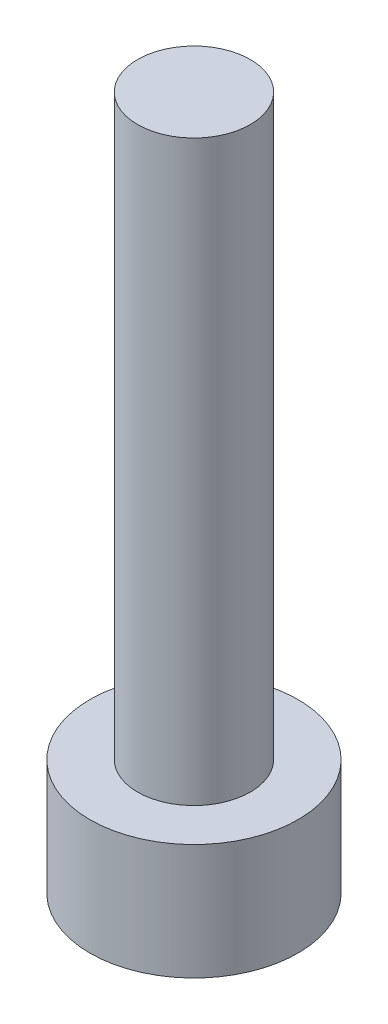
ISO-10303-21;
HEADER;
FILE_DESCRIPTION(('STEP AP214'),'2;1');
FILE_NAME('part.step','',(''),(''),'','','');
FILE_SCHEMA(('AUTOMOTIVE_DESIGN { 1 0 10303 214 1 1 1 1 }'));
ENDSEC;
DATA;
#1=APPLICATION_CONTEXT('core data for automotive mechanical design processes');
#2=APPLICATION_PROTOCOL_DEFINITION('international standard','automotive_design',2000,#1);
#3=PRODUCT_CONTEXT('',#1,'mechanical');
#4=PRODUCT('Part','Part','',(#3));
#5=PRODUCT_RELATED_PRODUCT_CATEGORY('part','',(#4));
#6=PRODUCT_DEFINITION_FORMATION('','',#4);
#7=PRODUCT_DEFINITION_CONTEXT('part definition',#1,'design');
#8=PRODUCT_DEFINITION('design','',#6,#7);
#9=PRODUCT_DEFINITION_SHAPE('','',#8);
#10=(LENGTH_UNIT() NAMED_UNIT(*) SI_UNIT(.MILLI.,.METRE.));
#11=(NAMED_UNIT(*) PLANE_ANGLE_UNIT() SI_UNIT($,.RADIAN.));
#12=(NAMED_UNIT(*) SI_UNIT($,.STERADIAN.) SOLID_ANGLE_UNIT());
#13=UNCERTAINTY_MEASURE_WITH_UNIT(LENGTH_MEASURE(1.E-05),#10,'distance_accuracy_value','');
#14=(GEOMETRIC_REPRESENTATION_CONTEXT(3) GLOBAL_UNCERTAINTY_ASSIGNED_CONTEXT((#13)) GLOBAL_UNIT_ASSIGNED_CONTEXT((#10,
#11,#12)) REPRESENTATION_CONTEXT('',''));
#15=CARTESIAN_POINT('',(0.,0.,0.));
#16=DIRECTION('',(0.,0.,1.));
#17=DIRECTION('',(1.,0.,0.));
#18=AXIS2_PLACEMENT_3D('',#15,#16,#17);
#19=CARTESIAN_POINT('',(0.,4.,0.));
#20=DIRECTION('',(0.,-1.,0.));
#21=DIRECTION('',(0.,0.,-1.));
#22=AXIS2_PLACEMENT_3D('',#19,#20,#21);
#23=CYLINDRICAL_SURFACE('',#22,3.6);
#24=CARTESIAN_POINT('',(0.,4.,0.));
#25=DIRECTION('',(0.,1.,0.));
#26=DIRECTION('',(0.,0.,1.));
#27=AXIS2_PLACEMENT_3D('',#24,#25,#26);
#28=CIRCLE('',#27,3.6);
#29=CARTESIAN_POINT('',(0.,4.,3.6));
#30=VERTEX_POINT('',#29);
#31=EDGE_CURVE('E44',#30,#30,#28,.T.);
#32=ORIENTED_EDGE('',*,*,#31,.F.);
#33=EDGE_LOOP('',(#32));
#34=FACE_BOUND('',#33,.T.);
#35=CARTESIAN_POINT('',(0.,0.,0.));
#36=DIRECTION('',(0.,1.,0.));
#37=DIRECTION('',(0.,0.,1.));
#38=AXIS2_PLACEMENT_3D('',#35,#36,#37);
#39=CIRCLE('',#38,3.6);
#40=CARTESIAN_POINT('',(0.,0.,3.6));
#41=VERTEX_POINT('',#40);
#42=EDGE_CURVE('E39',#41,#41,#39,.T.);
#43=ORIENTED_EDGE('',*,*,#42,.T.);
#44=EDGE_LOOP('',(#43));
#45=FACE_BOUND('',#44,.T.);
#46=ADVANCED_FACE('F36',(#34,#45),#23,.T.);
#47=CARTESIAN_POINT('',(0.,4.,0.));
#48=DIRECTION('',(0.,1.,0.));
#49=DIRECTION('',(0.,0.,1.));
#50=AXIS2_PLACEMENT_3D('',#47,#48,#49);
#51=PLANE('',#50);
#52=CARTESIAN_POINT('',(0.,4.,0.));
#53=DIRECTION('',(0.,1.,0.));
#54=DIRECTION('',(0.,0.,1.));
#55=AXIS2_PLACEMENT_3D('',#52,#53,#54);
#56=CIRCLE('',#55,1.95);
#57=CARTESIAN_POINT('',(0.,4.,1.95));
#58=VERTEX_POINT('',#57);
#59=EDGE_CURVE('E11',#58,#58,#56,.T.);
#60=ORIENTED_EDGE('',*,*,#59,.F.);
#61=EDGE_LOOP('',(#60));
#62=FACE_BOUND('',#61,.T.);
#63=ORIENTED_EDGE('',*,*,#31,.T.);
#64=EDGE_LOOP('',(#63));
#65=FACE_BOUND('',#64,.T.);
#66=ADVANCED_FACE('F156',(#62,#65),#51,.T.);
#67=CARTESIAN_POINT('',(0.,0.,0.));
#68=DIRECTION('',(0.,1.,0.));
#69=DIRECTION('',(0.,0.,1.));
#70=AXIS2_PLACEMENT_3D('',#67,#68,#69);
#71=PLANE('',#70);
#72=DIRECTION('',(-0.866025403784438,0.,-0.500000000000001));
#73=VECTOR('',#72,1.);
#74=CARTESIAN_POINT('',(0.,0.,2.02268156770335));
#75=LINE('',#74,#73);
#76=CARTESIAN_POINT('',(0.,0.,2.02268156770335));
#77=VERTEX_POINT('',#76);
#78=CARTESIAN_POINT('',(-1.75169362139764,0.,1.01134078385167));
#79=VERTEX_POINT('',#78);
#80=EDGE_CURVE('E126',#77,#79,#75,.T.);
#81=ORIENTED_EDGE('',*,*,#80,.F.);
#82=DIRECTION('',(-0.866025403784442,0.,0.499999999999995));
#83=VECTOR('',#82,1.);
#84=CARTESIAN_POINT('',(1.75169362139763,0.,1.0113407838517));
#85=LINE('',#84,#83);
#86=CARTESIAN_POINT('',(1.75169362139763,0.,1.0113407838517));
#87=VERTEX_POINT('',#86);
#88=EDGE_CURVE('E52',#87,#77,#85,.T.);
#89=ORIENTED_EDGE('',*,*,#88,.F.);
#90=DIRECTION('',(0.,0.,1.));
#91=VECTOR('',#90,1.);
#92=CARTESIAN_POINT('',(1.75169362139765,0.,-1.01134078385166));
#93=LINE('',#92,#91);
#94=CARTESIAN_POINT('',(1.75169362139765,0.,-1.01134078385166));
#95=VERTEX_POINT('',#94);
#96=EDGE_CURVE('E135',#95,#87,#93,.T.);
#97=ORIENTED_EDGE('',*,*,#96,.F.);
#98=DIRECTION('',(0.866025403784435,0.,0.500000000000007));
#99=VECTOR('',#98,1.);
#100=CARTESIAN_POINT('',(0.,0.,-2.02268156770335));
#101=LINE('',#100,#99);
#102=CARTESIAN_POINT('',(0.,0.,-2.02268156770335));
#103=VERTEX_POINT('',#102);
#104=EDGE_CURVE('E133',#103,#95,#101,.T.);
#105=ORIENTED_EDGE('',*,*,#104,.F.);
#106=DIRECTION('',(0.866025403784442,0.,-0.499999999999995));
#107=VECTOR('',#106,1.);
#108=CARTESIAN_POINT('',(-1.75169362139763,0.,-1.01134078385169));
#109=LINE('',#108,#107);
#110=CARTESIAN_POINT('',(-1.75169362139763,0.,-1.01134078385169));
#111=VERTEX_POINT('',#110);
#112=EDGE_CURVE('E100',#111,#103,#109,.T.);
#113=ORIENTED_EDGE('',*,*,#112,.F.);
#114=DIRECTION('',(0.,0.,-1.));
#115=VECTOR('',#114,1.);
#116=CARTESIAN_POINT('',(-1.75169362139764,0.,1.01134078385167));
#117=LINE('',#116,#115);
#118=EDGE_CURVE('E129',#79,#111,#117,.T.);
#119=ORIENTED_EDGE('',*,*,#118,.F.);
#120=EDGE_LOOP('',(#81,#89,#97,#105,#113,#119));
#121=FACE_BOUND('',#120,.T.);
#122=ORIENTED_EDGE('',*,*,#42,.F.);
#123=EDGE_LOOP('',(#122));
#124=FACE_BOUND('',#123,.T.);
#125=ADVANCED_FACE('F153',(#121,#124),#71,.F.);
#126=CARTESIAN_POINT('',(0.,24.,0.));
#127=DIRECTION('',(0.,-1.,0.));
#128=DIRECTION('',(0.,0.,-1.));
#129=AXIS2_PLACEMENT_3D('',#126,#127,#128);
#130=CYLINDRICAL_SURFACE('',#129,1.95);
#131=CARTESIAN_POINT('',(0.,24.,0.));
#132=DIRECTION('',(0.,1.,0.));
#133=DIRECTION('',(0.,0.,1.));
#134=AXIS2_PLACEMENT_3D('',#131,#132,#133);
#135=CIRCLE('',#134,1.95);
#136=CARTESIAN_POINT('',(0.,24.,1.95));
#137=VERTEX_POINT('',#136);
#138=EDGE_CURVE('E139',#137,#137,#135,.T.);
#139=ORIENTED_EDGE('',*,*,#138,.F.);
#140=EDGE_LOOP('',(#139));
#141=FACE_BOUND('',#140,.T.);
#142=ORIENTED_EDGE('',*,*,#59,.T.);
#143=EDGE_LOOP('',(#142));
#144=FACE_BOUND('',#143,.T.);
#145=ADVANCED_FACE('F155',(#141,#144),#130,.T.);
#146=CARTESIAN_POINT('',(0.,24.,0.));
#147=DIRECTION('',(0.,1.,0.));
#148=DIRECTION('',(0.,0.,1.));
#149=AXIS2_PLACEMENT_3D('',#146,#147,#148);
#150=PLANE('',#149);
#151=ORIENTED_EDGE('',*,*,#138,.T.);
#152=EDGE_LOOP('',(#151));
#153=FACE_BOUND('',#152,.T.);
#154=ADVANCED_FACE('F162',(#153),#150,.T.);
#155=CARTESIAN_POINT('',(1.75169362139763,2.,1.0113407838517));
#156=DIRECTION('',(0.499999999999995,0.,0.866025403784441));
#157=DIRECTION('',(0.866025403784442,0.,-0.499999999999995));
#158=AXIS2_PLACEMENT_3D('',#155,#156,#157);
#159=PLANE('',#158);
#160=ORIENTED_EDGE('',*,*,#88,.T.);
#161=DIRECTION('',(0.,-1.,0.));
#162=VECTOR('',#161,1.);
#163=CARTESIAN_POINT('',(0.,2.,2.02268156770335));
#164=LINE('',#163,#162);
#165=CARTESIAN_POINT('',(0.,2.,2.02268156770335));
#166=VERTEX_POINT('',#165);
#167=EDGE_CURVE('E82',#166,#77,#164,.T.);
#168=ORIENTED_EDGE('',*,*,#167,.F.);
#169=DIRECTION('',(-0.866025403784442,0.,0.499999999999995));
#170=VECTOR('',#169,1.);
#171=CARTESIAN_POINT('',(1.75169362139763,2.,1.0113407838517));
#172=LINE('',#171,#170);
#173=CARTESIAN_POINT('',(1.75169362139763,2.,1.0113407838517));
#174=VERTEX_POINT('',#173);
#175=EDGE_CURVE('E137',#174,#166,#172,.T.);
#176=ORIENTED_EDGE('',*,*,#175,.F.);
#177=DIRECTION('',(0.,-1.,0.));
#178=VECTOR('',#177,1.);
#179=CARTESIAN_POINT('',(1.75169362139763,2.,1.0113407838517));
#180=LINE('',#179,#178);
#181=EDGE_CURVE('E60',#174,#87,#180,.T.);
#182=ORIENTED_EDGE('',*,*,#181,.T.);
#183=EDGE_LOOP('',(#160,#168,#176,#182));
#184=FACE_BOUND('',#183,.T.);
#185=ADVANCED_FACE('F191',(#184),#159,.F.);
#186=CARTESIAN_POINT('',(1.75169362139765,2.,-1.01134078385166));
#187=DIRECTION('',(1.,0.,0.));
#188=DIRECTION('',(0.,0.,-1.));
#189=AXIS2_PLACEMENT_3D('',#186,#187,#188);
#190=PLANE('',#189);
#191=ORIENTED_EDGE('',*,*,#96,.T.);
#192=ORIENTED_EDGE('',*,*,#181,.F.);
#193=DIRECTION('',(0.,0.,1.));
#194=VECTOR('',#193,1.);
#195=CARTESIAN_POINT('',(1.75169362139765,2.,-1.01134078385166));
#196=LINE('',#195,#194);
#197=CARTESIAN_POINT('',(1.75169362139765,2.,-1.01134078385166));
#198=VERTEX_POINT('',#197);
#199=EDGE_CURVE('E112',#198,#174,#196,.T.);
#200=ORIENTED_EDGE('',*,*,#199,.F.);
#201=DIRECTION('',(0.,-1.,0.));
#202=VECTOR('',#201,1.);
#203=CARTESIAN_POINT('',(1.75169362139765,2.,-1.01134078385166));
#204=LINE('',#203,#202);
#205=EDGE_CURVE('E104',#198,#95,#204,.T.);
#206=ORIENTED_EDGE('',*,*,#205,.T.);
#207=EDGE_LOOP('',(#191,#192,#200,#206));
#208=FACE_BOUND('',#207,.T.);
#209=ADVANCED_FACE('F205',(#208),#190,.F.);
#210=CARTESIAN_POINT('',(0.,2.,-2.02268156770335));
#211=DIRECTION('',(0.500000000000007,0.,-0.866025403784434));
#212=DIRECTION('',(-0.866025403784435,0.,-0.500000000000007));
#213=AXIS2_PLACEMENT_3D('',#210,#211,#212);
#214=PLANE('',#213);
#215=ORIENTED_EDGE('',*,*,#104,.T.);
#216=ORIENTED_EDGE('',*,*,#205,.F.);
#217=DIRECTION('',(0.866025403784435,0.,0.500000000000007));
#218=VECTOR('',#217,1.);
#219=CARTESIAN_POINT('',(0.,2.,-2.02268156770335));
#220=LINE('',#219,#218);
#221=CARTESIAN_POINT('',(0.,2.,-2.02268156770335));
#222=VERTEX_POINT('',#221);
#223=EDGE_CURVE('E108',#222,#198,#220,.T.);
#224=ORIENTED_EDGE('',*,*,#223,.F.);
#225=DIRECTION('',(0.,-1.,0.));
#226=VECTOR('',#225,1.);
#227=CARTESIAN_POINT('',(0.,2.,-2.02268156770335));
#228=LINE('',#227,#226);
#229=EDGE_CURVE('E93',#222,#103,#228,.T.);
#230=ORIENTED_EDGE('',*,*,#229,.T.);
#231=EDGE_LOOP('',(#215,#216,#224,#230));
#232=FACE_BOUND('',#231,.T.);
#233=ADVANCED_FACE('F109',(#232),#214,.F.);
#234=CARTESIAN_POINT('',(-1.75169362139763,2.,-1.01134078385169));
#235=DIRECTION('',(-0.499999999999995,0.,-0.866025403784441));
#236=DIRECTION('',(-0.866025403784442,0.,0.499999999999995));
#237=AXIS2_PLACEMENT_3D('',#234,#235,#236);
#238=PLANE('',#237);
#239=ORIENTED_EDGE('',*,*,#112,.T.);
#240=ORIENTED_EDGE('',*,*,#229,.F.);
#241=DIRECTION('',(0.866025403784442,0.,-0.499999999999995));
#242=VECTOR('',#241,1.);
#243=CARTESIAN_POINT('',(-1.75169362139763,2.,-1.01134078385169));
#244=LINE('',#243,#242);
#245=CARTESIAN_POINT('',(-1.75169362139763,2.,-1.01134078385169));
#246=VERTEX_POINT('',#245);
#247=EDGE_CURVE('E97',#246,#222,#244,.T.);
#248=ORIENTED_EDGE('',*,*,#247,.F.);
#249=DIRECTION('',(0.,-1.,0.));
#250=VECTOR('',#249,1.);
#251=CARTESIAN_POINT('',(-1.75169362139763,2.,-1.01134078385169));
#252=LINE('',#251,#250);
#253=EDGE_CURVE('E105',#246,#111,#252,.T.);
#254=ORIENTED_EDGE('',*,*,#253,.T.);
#255=EDGE_LOOP('',(#239,#240,#248,#254));
#256=FACE_BOUND('',#255,.T.);
#257=ADVANCED_FACE('F95',(#256),#238,.F.);
#258=CARTESIAN_POINT('',(-1.75169362139764,2.,1.01134078385167));
#259=DIRECTION('',(-1.,0.,0.));
#260=DIRECTION('',(0.,0.,1.));
#261=AXIS2_PLACEMENT_3D('',#258,#259,#260);
#262=PLANE('',#261);
#263=ORIENTED_EDGE('',*,*,#118,.T.);
#264=ORIENTED_EDGE('',*,*,#253,.F.);
#265=DIRECTION('',(0.,0.,-1.));
#266=VECTOR('',#265,1.);
#267=CARTESIAN_POINT('',(-1.75169362139764,2.,1.01134078385167));
#268=LINE('',#267,#266);
#269=CARTESIAN_POINT('',(-1.75169362139764,2.,1.01134078385167));
#270=VERTEX_POINT('',#269);
#271=EDGE_CURVE('E118',#270,#246,#268,.T.);
#272=ORIENTED_EDGE('',*,*,#271,.F.);
#273=DIRECTION('',(0.,-1.,0.));
#274=VECTOR('',#273,1.);
#275=CARTESIAN_POINT('',(-1.75169362139764,2.,1.01134078385167));
#276=LINE('',#275,#274);
#277=EDGE_CURVE('E142',#270,#79,#276,.T.);
#278=ORIENTED_EDGE('',*,*,#277,.T.);
#279=EDGE_LOOP('',(#263,#264,#272,#278));
#280=FACE_BOUND('',#279,.T.);
#281=ADVANCED_FACE('F230',(#280),#262,.F.);
#282=CARTESIAN_POINT('',(0.,2.,2.02268156770335));
#283=DIRECTION('',(-0.500000000000001,0.,0.866025403784438));
#284=DIRECTION('',(0.866025403784438,0.,0.500000000000001));
#285=AXIS2_PLACEMENT_3D('',#282,#283,#284);
#286=PLANE('',#285);
#287=ORIENTED_EDGE('',*,*,#80,.T.);
#288=ORIENTED_EDGE('',*,*,#277,.F.);
#289=DIRECTION('',(-0.866025403784438,0.,-0.500000000000001));
#290=VECTOR('',#289,1.);
#291=CARTESIAN_POINT('',(0.,2.,2.02268156770335));
#292=LINE('',#291,#290);
#293=EDGE_CURVE('E120',#166,#270,#292,.T.);
#294=ORIENTED_EDGE('',*,*,#293,.F.);
#295=ORIENTED_EDGE('',*,*,#167,.T.);
#296=EDGE_LOOP('',(#287,#288,#294,#295));
#297=FACE_BOUND('',#296,.T.);
#298=ADVANCED_FACE('F239',(#297),#286,.F.);
#299=CARTESIAN_POINT('',(0.,2.,0.));
#300=DIRECTION('',(0.,-1.,0.));
#301=DIRECTION('',(0.,0.,-1.));
#302=AXIS2_PLACEMENT_3D('',#299,#300,#301);
#303=PLANE('',#302);
#304=ORIENTED_EDGE('',*,*,#175,.T.);
#305=ORIENTED_EDGE('',*,*,#293,.T.);
#306=ORIENTED_EDGE('',*,*,#271,.T.);
#307=ORIENTED_EDGE('',*,*,#247,.T.);
#308=ORIENTED_EDGE('',*,*,#223,.T.);
#309=ORIENTED_EDGE('',*,*,#199,.T.);
#310=EDGE_LOOP('',(#304,#305,#306,#307,#308,#309));
#311=FACE_BOUND('',#310,.T.);
#312=ADVANCED_FACE('F115',(#311),#303,.T.);
#313=CLOSED_SHELL('',(#46,#66,#125,#145,#154,#185,#209,#233,#257,#281,#298,#312));
#314=MANIFOLD_SOLID_BREP('B2',#313);
#315=ADVANCED_BREP_SHAPE_REPRESENTATION('',(#18,#314),#14);
#316=SHAPE_DEFINITION_REPRESENTATION(#9,#315);
ENDSEC;
END-ISO-10303-21;
